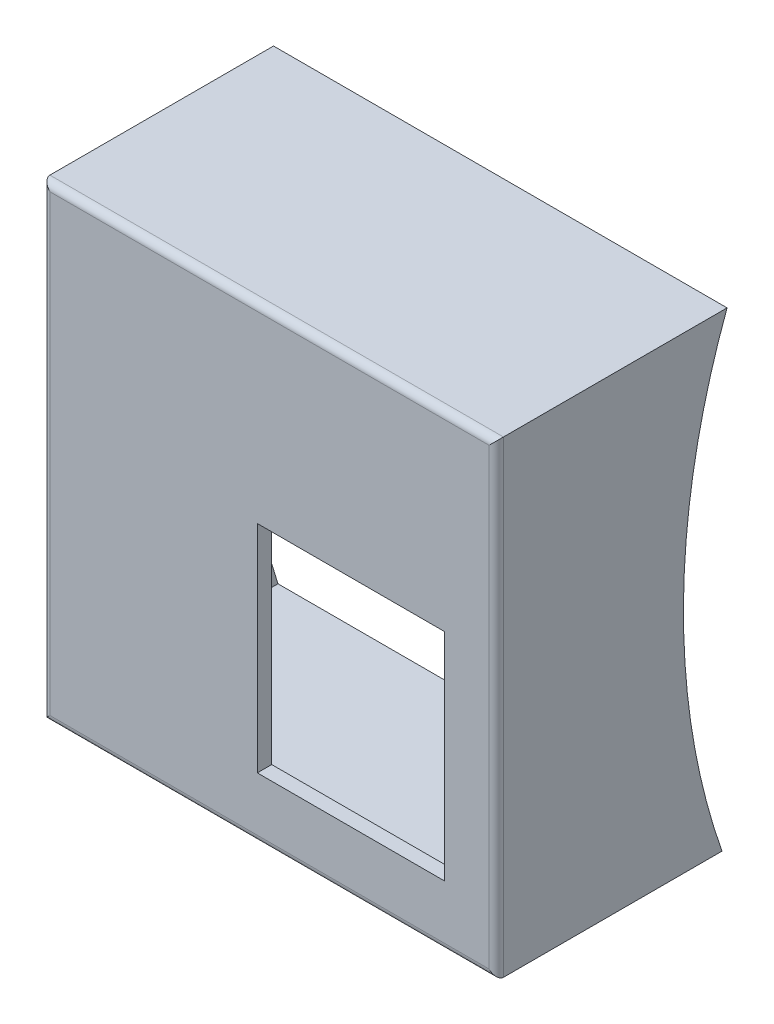
ISO-10303-21;
HEADER;
FILE_DESCRIPTION(('STEP AP214'),'2;1');
FILE_NAME('part.step','',(''),(''),'','','');
FILE_SCHEMA(('AUTOMOTIVE_DESIGN { 1 0 10303 214 1 1 1 1 }'));
ENDSEC;
DATA;
#1=APPLICATION_CONTEXT('core data for automotive mechanical design processes');
#2=APPLICATION_PROTOCOL_DEFINITION('international standard','automotive_design',2000,#1);
#3=PRODUCT_CONTEXT('',#1,'mechanical');
#4=PRODUCT('Part','Part','',(#3));
#5=PRODUCT_RELATED_PRODUCT_CATEGORY('part','',(#4));
#6=PRODUCT_DEFINITION_FORMATION('','',#4);
#7=PRODUCT_DEFINITION_CONTEXT('part definition',#1,'design');
#8=PRODUCT_DEFINITION('design','',#6,#7);
#9=PRODUCT_DEFINITION_SHAPE('','',#8);
#10=(LENGTH_UNIT() NAMED_UNIT(*) SI_UNIT(.MILLI.,.METRE.));
#11=(NAMED_UNIT(*) PLANE_ANGLE_UNIT() SI_UNIT($,.RADIAN.));
#12=(NAMED_UNIT(*) SI_UNIT($,.STERADIAN.) SOLID_ANGLE_UNIT());
#13=UNCERTAINTY_MEASURE_WITH_UNIT(LENGTH_MEASURE(1.E-05),#10,'distance_accuracy_value','');
#14=(GEOMETRIC_REPRESENTATION_CONTEXT(3) GLOBAL_UNCERTAINTY_ASSIGNED_CONTEXT((#13)) GLOBAL_UNIT_ASSIGNED_CONTEXT((#10,
#11,#12)) REPRESENTATION_CONTEXT('',''));
#15=CARTESIAN_POINT('',(0.,0.,0.));
#16=DIRECTION('',(0.,0.,1.));
#17=DIRECTION('',(1.,0.,0.));
#18=AXIS2_PLACEMENT_3D('',#15,#16,#17);
#19=CARTESIAN_POINT('',(-29.5,32.5,35.));
#20=DIRECTION('',(0.,-1.,0.));
#21=DIRECTION('',(0.,0.,-1.));
#22=AXIS2_PLACEMENT_3D('',#19,#20,#21);
#23=PLANE('',#22);
#24=DIRECTION('',(-1.,0.,0.));
#25=VECTOR('',#24,1.);
#26=CARTESIAN_POINT('',(34.9310414342069,32.5,4.93868352384369));
#27=LINE('',#26,#25);
#28=CARTESIAN_POINT('',(-31.5,32.5,4.93868352384369));
#29=VERTEX_POINT('',#28);
#30=CARTESIAN_POINT('',(31.5,32.5,4.93868352384369));
#31=VERTEX_POINT('',#30);
#32=EDGE_CURVE('E214',#29,#31,#27,.F.);
#33=ORIENTED_EDGE('',*,*,#32,.F.);
#34=DIRECTION('',(0.,0.,-1.));
#35=VECTOR('',#34,1.);
#36=CARTESIAN_POINT('',(-31.5,32.5,35.));
#37=LINE('',#36,#35);
#38=CARTESIAN_POINT('',(-31.5,32.5,36.));
#39=VERTEX_POINT('',#38);
#40=EDGE_CURVE('E186',#39,#29,#37,.T.);
#41=ORIENTED_EDGE('',*,*,#40,.F.);
#42=DIRECTION('',(-1.,0.,0.));
#43=VECTOR('',#42,1.);
#44=CARTESIAN_POINT('',(-29.5,32.5,36.));
#45=LINE('',#44,#43);
#46=CARTESIAN_POINT('',(31.5,32.5,36.));
#47=VERTEX_POINT('',#46);
#48=EDGE_CURVE('E159',#39,#47,#45,.F.);
#49=ORIENTED_EDGE('',*,*,#48,.T.);
#50=DIRECTION('',(0.,0.,-1.));
#51=VECTOR('',#50,1.);
#52=CARTESIAN_POINT('',(31.5,32.5,35.));
#53=LINE('',#52,#51);
#54=EDGE_CURVE('E180',#47,#31,#53,.T.);
#55=ORIENTED_EDGE('',*,*,#54,.T.);
#56=EDGE_LOOP('',(#33,#41,#49,#55));
#57=FACE_BOUND('',#56,.T.);
#58=ADVANCED_FACE('F33',(#57),#23,.F.);
#59=CARTESIAN_POINT('',(-29.5,-32.5,35.));
#60=DIRECTION('',(0.,1.,0.));
#61=DIRECTION('',(0.,0.,1.));
#62=AXIS2_PLACEMENT_3D('',#59,#60,#61);
#63=PLANE('',#62);
#64=DIRECTION('',(-1.,0.,0.));
#65=VECTOR('',#64,1.);
#66=CARTESIAN_POINT('',(34.9310414342069,-32.5,5.64631503967474));
#67=LINE('',#66,#65);
#68=CARTESIAN_POINT('',(31.5,-32.5,5.64631503967474));
#69=VERTEX_POINT('',#68);
#70=CARTESIAN_POINT('',(-31.5,-32.5,5.64631503967473));
#71=VERTEX_POINT('',#70);
#72=EDGE_CURVE('E213',#69,#71,#67,.T.);
#73=ORIENTED_EDGE('',*,*,#72,.F.);
#74=DIRECTION('',(0.,0.,-1.));
#75=VECTOR('',#74,1.);
#76=CARTESIAN_POINT('',(31.5,-32.5,35.));
#77=LINE('',#76,#75);
#78=CARTESIAN_POINT('',(31.5,-32.5,36.));
#79=VERTEX_POINT('',#78);
#80=EDGE_CURVE('E183',#79,#69,#77,.T.);
#81=ORIENTED_EDGE('',*,*,#80,.F.);
#82=DIRECTION('',(1.,0.,0.));
#83=VECTOR('',#82,1.);
#84=CARTESIAN_POINT('',(-29.5,-32.5,36.));
#85=LINE('',#84,#83);
#86=CARTESIAN_POINT('',(-31.5,-32.5,36.));
#87=VERTEX_POINT('',#86);
#88=EDGE_CURVE('E187',#79,#87,#85,.F.);
#89=ORIENTED_EDGE('',*,*,#88,.T.);
#90=DIRECTION('',(0.,0.,-1.));
#91=VECTOR('',#90,1.);
#92=CARTESIAN_POINT('',(-31.5,-32.5,35.));
#93=LINE('',#92,#91);
#94=EDGE_CURVE('E190',#87,#71,#93,.T.);
#95=ORIENTED_EDGE('',*,*,#94,.T.);
#96=EDGE_LOOP('',(#73,#81,#89,#95));
#97=FACE_BOUND('',#96,.T.);
#98=ADVANCED_FACE('F267',(#97),#63,.F.);
#99=CARTESIAN_POINT('',(-29.5,30.5,35.));
#100=DIRECTION('',(0.,-1.,0.));
#101=DIRECTION('',(0.,0.,-1.));
#102=AXIS2_PLACEMENT_3D('',#99,#100,#101);
#103=PLANE('',#102);
#104=DIRECTION('',(0.,0.,-1.));
#105=VECTOR('',#104,1.);
#106=CARTESIAN_POINT('',(-29.5,30.5,35.));
#107=LINE('',#106,#105);
#108=CARTESIAN_POINT('',(-29.5,30.5,35.));
#109=VERTEX_POINT('',#108);
#110=CARTESIAN_POINT('',(-29.5,30.5,5.66200140068614));
#111=VERTEX_POINT('',#110);
#112=EDGE_CURVE('E224',#109,#111,#107,.T.);
#113=ORIENTED_EDGE('',*,*,#112,.T.);
#114=DIRECTION('',(-1.,0.,0.));
#115=VECTOR('',#114,1.);
#116=CARTESIAN_POINT('',(34.9310414342069,30.5,5.66200140068614));
#117=LINE('',#116,#115);
#118=CARTESIAN_POINT('',(29.5,30.5,5.66200140068614));
#119=VERTEX_POINT('',#118);
#120=EDGE_CURVE('E206',#111,#119,#117,.F.);
#121=ORIENTED_EDGE('',*,*,#120,.T.);
#122=DIRECTION('',(0.,0.,-1.));
#123=VECTOR('',#122,1.);
#124=CARTESIAN_POINT('',(29.5,30.5,35.));
#125=LINE('',#124,#123);
#126=CARTESIAN_POINT('',(29.5,30.5,35.));
#127=VERTEX_POINT('',#126);
#128=EDGE_CURVE('E200',#127,#119,#125,.T.);
#129=ORIENTED_EDGE('',*,*,#128,.F.);
#130=DIRECTION('',(-1.,0.,0.));
#131=VECTOR('',#130,1.);
#132=CARTESIAN_POINT('',(-29.5,30.5,35.));
#133=LINE('',#132,#131);
#134=EDGE_CURVE('E204',#127,#109,#133,.T.);
#135=ORIENTED_EDGE('',*,*,#134,.T.);
#136=EDGE_LOOP('',(#113,#121,#129,#135));
#137=FACE_BOUND('',#136,.T.);
#138=ADVANCED_FACE('F273',(#137),#103,.T.);
#139=CARTESIAN_POINT('',(-29.5,-30.5,35.));
#140=DIRECTION('',(0.,1.,0.));
#141=DIRECTION('',(0.,0.,1.));
#142=AXIS2_PLACEMENT_3D('',#139,#140,#141);
#143=PLANE('',#142);
#144=DIRECTION('',(0.,0.,-1.));
#145=VECTOR('',#144,1.);
#146=CARTESIAN_POINT('',(29.5,-30.5,35.));
#147=LINE('',#146,#145);
#148=CARTESIAN_POINT('',(29.5,-30.5,35.));
#149=VERTEX_POINT('',#148);
#150=CARTESIAN_POINT('',(29.5,-30.5,6.32095686719458));
#151=VERTEX_POINT('',#150);
#152=EDGE_CURVE('E166',#149,#151,#147,.T.);
#153=ORIENTED_EDGE('',*,*,#152,.T.);
#154=DIRECTION('',(-1.,0.,0.));
#155=VECTOR('',#154,1.);
#156=CARTESIAN_POINT('',(34.9310414342069,-30.5,6.32095686719458));
#157=LINE('',#156,#155);
#158=CARTESIAN_POINT('',(-29.5,-30.5,6.32095686719458));
#159=VERTEX_POINT('',#158);
#160=EDGE_CURVE('E162',#151,#159,#157,.T.);
#161=ORIENTED_EDGE('',*,*,#160,.T.);
#162=DIRECTION('',(0.,0.,-1.));
#163=VECTOR('',#162,1.);
#164=CARTESIAN_POINT('',(-29.5,-30.5,35.));
#165=LINE('',#164,#163);
#166=CARTESIAN_POINT('',(-29.5,-30.5,35.));
#167=VERTEX_POINT('',#166);
#168=EDGE_CURVE('E210',#167,#159,#165,.T.);
#169=ORIENTED_EDGE('',*,*,#168,.F.);
#170=DIRECTION('',(1.,0.,0.));
#171=VECTOR('',#170,1.);
#172=CARTESIAN_POINT('',(-29.5,-30.5,35.));
#173=LINE('',#172,#171);
#174=EDGE_CURVE('E165',#167,#149,#173,.T.);
#175=ORIENTED_EDGE('',*,*,#174,.T.);
#176=EDGE_LOOP('',(#153,#161,#169,#175));
#177=FACE_BOUND('',#176,.T.);
#178=ADVANCED_FACE('F283',(#177),#143,.T.);
#179=CARTESIAN_POINT('',(31.5,-30.5,35.));
#180=DIRECTION('',(-1.,0.,0.));
#181=DIRECTION('',(0.,0.,1.));
#182=AXIS2_PLACEMENT_3D('',#179,#180,#181);
#183=PLANE('',#182);
#184=CARTESIAN_POINT('',(31.5,-0.977552215280204,-84.5012600006979));
#185=DIRECTION('',(-1.,0.,0.));
#186=DIRECTION('',(0.,0.,1.));
#187=AXIS2_PLACEMENT_3D('',#184,#185,#186);
#188=CIRCLE('',#187,95.5);
#189=EDGE_CURVE('E178',#31,#69,#188,.F.);
#190=ORIENTED_EDGE('',*,*,#189,.F.);
#191=ORIENTED_EDGE('',*,*,#54,.F.);
#192=DIRECTION('',(0.,1.,0.));
#193=VECTOR('',#192,1.);
#194=CARTESIAN_POINT('',(31.5,-30.5,36.));
#195=LINE('',#194,#193);
#196=EDGE_CURVE('E181',#47,#79,#195,.F.);
#197=ORIENTED_EDGE('',*,*,#196,.T.);
#198=ORIENTED_EDGE('',*,*,#80,.T.);
#199=EDGE_LOOP('',(#190,#191,#197,#198));
#200=FACE_BOUND('',#199,.T.);
#201=ADVANCED_FACE('F280',(#200),#183,.F.);
#202=CARTESIAN_POINT('',(-31.5,-30.5,35.));
#203=DIRECTION('',(1.,0.,0.));
#204=DIRECTION('',(0.,0.,-1.));
#205=AXIS2_PLACEMENT_3D('',#202,#203,#204);
#206=PLANE('',#205);
#207=CARTESIAN_POINT('',(-31.5,-0.977552215280203,-84.5012600006979));
#208=DIRECTION('',(1.,0.,0.));
#209=DIRECTION('',(0.,0.,-1.));
#210=AXIS2_PLACEMENT_3D('',#207,#208,#209);
#211=CIRCLE('',#210,95.5);
#212=EDGE_CURVE('E217',#71,#29,#211,.F.);
#213=ORIENTED_EDGE('',*,*,#212,.F.);
#214=ORIENTED_EDGE('',*,*,#94,.F.);
#215=DIRECTION('',(0.,-1.,0.));
#216=VECTOR('',#215,1.);
#217=CARTESIAN_POINT('',(-31.5,-30.5,36.));
#218=LINE('',#217,#216);
#219=EDGE_CURVE('E184',#87,#39,#218,.F.);
#220=ORIENTED_EDGE('',*,*,#219,.T.);
#221=ORIENTED_EDGE('',*,*,#40,.T.);
#222=EDGE_LOOP('',(#213,#214,#220,#221));
#223=FACE_BOUND('',#222,.T.);
#224=ADVANCED_FACE('F279',(#223),#206,.F.);
#225=CARTESIAN_POINT('',(0.,0.,37.));
#226=DIRECTION('',(0.,0.,-1.));
#227=DIRECTION('',(-1.,0.,0.));
#228=AXIS2_PLACEMENT_3D('',#225,#226,#227);
#229=PLANE('',#228);
#230=DIRECTION('',(-1.,0.,0.));
#231=VECTOR('',#230,1.);
#232=CARTESIAN_POINT('',(24.3111325786551,5.99879463488067,37.));
#233=LINE('',#232,#231);
#234=CARTESIAN_POINT('',(24.3111325786551,5.99879463488067,37.));
#235=VERTEX_POINT('',#234);
#236=CARTESIAN_POINT('',(-1.68886742134489,5.99879463488067,37.));
#237=VERTEX_POINT('',#236);
#238=EDGE_CURVE('E145',#235,#237,#233,.T.);
#239=ORIENTED_EDGE('',*,*,#238,.F.);
#240=DIRECTION('',(0.,1.,0.));
#241=VECTOR('',#240,1.);
#242=CARTESIAN_POINT('',(24.3111325786551,-24.0012053651193,37.));
#243=LINE('',#242,#241);
#244=CARTESIAN_POINT('',(24.3111325786551,-24.0012053651193,37.));
#245=VERTEX_POINT('',#244);
#246=EDGE_CURVE('E48',#245,#235,#243,.T.);
#247=ORIENTED_EDGE('',*,*,#246,.F.);
#248=DIRECTION('',(1.,0.,0.));
#249=VECTOR('',#248,1.);
#250=CARTESIAN_POINT('',(24.3111325786551,-24.0012053651193,37.));
#251=LINE('',#250,#249);
#252=CARTESIAN_POINT('',(-1.68886742134489,-24.0012053651193,37.));
#253=VERTEX_POINT('',#252);
#254=EDGE_CURVE('E152',#253,#245,#251,.T.);
#255=ORIENTED_EDGE('',*,*,#254,.F.);
#256=DIRECTION('',(0.,-1.,0.));
#257=VECTOR('',#256,1.);
#258=CARTESIAN_POINT('',(-1.68886742134489,-24.0012053651193,37.));
#259=LINE('',#258,#257);
#260=EDGE_CURVE('E136',#237,#253,#259,.T.);
#261=ORIENTED_EDGE('',*,*,#260,.F.);
#262=EDGE_LOOP('',(#239,#247,#255,#261));
#263=FACE_BOUND('',#262,.T.);
#264=DIRECTION('',(0.,-1.,0.));
#265=VECTOR('',#264,1.);
#266=CARTESIAN_POINT('',(-30.5,0.,37.));
#267=LINE('',#266,#265);
#268=CARTESIAN_POINT('',(-30.5,31.5,37.));
#269=VERTEX_POINT('',#268);
#270=CARTESIAN_POINT('',(-30.5,-31.5,37.));
#271=VERTEX_POINT('',#270);
#272=EDGE_CURVE('E195',#269,#271,#267,.T.);
#273=ORIENTED_EDGE('',*,*,#272,.T.);
#274=DIRECTION('',(1.,0.,0.));
#275=VECTOR('',#274,1.);
#276=CARTESIAN_POINT('',(0.,-31.5,37.));
#277=LINE('',#276,#275);
#278=CARTESIAN_POINT('',(30.5,-31.5,37.));
#279=VERTEX_POINT('',#278);
#280=EDGE_CURVE('E191',#271,#279,#277,.T.);
#281=ORIENTED_EDGE('',*,*,#280,.T.);
#282=DIRECTION('',(0.,1.,0.));
#283=VECTOR('',#282,1.);
#284=CARTESIAN_POINT('',(30.5,0.,37.));
#285=LINE('',#284,#283);
#286=CARTESIAN_POINT('',(30.5,31.5,37.));
#287=VERTEX_POINT('',#286);
#288=EDGE_CURVE('E194',#279,#287,#285,.T.);
#289=ORIENTED_EDGE('',*,*,#288,.T.);
#290=DIRECTION('',(-1.,0.,0.));
#291=VECTOR('',#290,1.);
#292=CARTESIAN_POINT('',(0.,31.5,37.));
#293=LINE('',#292,#291);
#294=EDGE_CURVE('E198',#287,#269,#293,.T.);
#295=ORIENTED_EDGE('',*,*,#294,.T.);
#296=EDGE_LOOP('',(#273,#281,#289,#295));
#297=FACE_BOUND('',#296,.T.);
#298=ADVANCED_FACE('F149',(#263,#297),#229,.F.);
#299=CARTESIAN_POINT('',(29.5,-30.5,35.));
#300=DIRECTION('',(-1.,0.,0.));
#301=DIRECTION('',(0.,0.,1.));
#302=AXIS2_PLACEMENT_3D('',#299,#300,#301);
#303=PLANE('',#302);
#304=ORIENTED_EDGE('',*,*,#128,.T.);
#305=CARTESIAN_POINT('',(29.5,-0.977552215280204,-84.5012600006979));
#306=DIRECTION('',(-1.,0.,0.));
#307=DIRECTION('',(0.,0.,1.));
#308=AXIS2_PLACEMENT_3D('',#305,#306,#307);
#309=CIRCLE('',#308,95.5);
#310=EDGE_CURVE('E211',#119,#151,#309,.F.);
#311=ORIENTED_EDGE('',*,*,#310,.T.);
#312=ORIENTED_EDGE('',*,*,#152,.F.);
#313=DIRECTION('',(0.,1.,0.));
#314=VECTOR('',#313,1.);
#315=CARTESIAN_POINT('',(29.5,-30.5,35.));
#316=LINE('',#315,#314);
#317=EDGE_CURVE('E207',#149,#127,#316,.T.);
#318=ORIENTED_EDGE('',*,*,#317,.T.);
#319=EDGE_LOOP('',(#304,#311,#312,#318));
#320=FACE_BOUND('',#319,.T.);
#321=ADVANCED_FACE('F35',(#320),#303,.T.);
#322=CARTESIAN_POINT('',(-29.5,-30.5,35.));
#323=DIRECTION('',(1.,0.,0.));
#324=DIRECTION('',(0.,0.,-1.));
#325=AXIS2_PLACEMENT_3D('',#322,#323,#324);
#326=PLANE('',#325);
#327=ORIENTED_EDGE('',*,*,#168,.T.);
#328=CARTESIAN_POINT('',(-29.5,-0.977552215280203,-84.5012600006979));
#329=DIRECTION('',(1.,0.,0.));
#330=DIRECTION('',(0.,0.,-1.));
#331=AXIS2_PLACEMENT_3D('',#328,#329,#330);
#332=CIRCLE('',#331,95.5);
#333=EDGE_CURVE('E203',#159,#111,#332,.F.);
#334=ORIENTED_EDGE('',*,*,#333,.T.);
#335=ORIENTED_EDGE('',*,*,#112,.F.);
#336=DIRECTION('',(0.,-1.,0.));
#337=VECTOR('',#336,1.);
#338=CARTESIAN_POINT('',(-29.5,-30.5,35.));
#339=LINE('',#338,#337);
#340=EDGE_CURVE('E171',#109,#167,#339,.T.);
#341=ORIENTED_EDGE('',*,*,#340,.T.);
#342=EDGE_LOOP('',(#327,#334,#335,#341));
#343=FACE_BOUND('',#342,.T.);
#344=ADVANCED_FACE('F288',(#343),#326,.T.);
#345=CARTESIAN_POINT('',(0.,0.,35.));
#346=DIRECTION('',(0.,0.,-1.));
#347=DIRECTION('',(-1.,0.,0.));
#348=AXIS2_PLACEMENT_3D('',#345,#346,#347);
#349=PLANE('',#348);
#350=DIRECTION('',(0.,-1.,0.));
#351=VECTOR('',#350,1.);
#352=CARTESIAN_POINT('',(24.3111325786551,0.,35.));
#353=LINE('',#352,#351);
#354=CARTESIAN_POINT('',(24.3111325786551,5.99879463488067,35.));
#355=VERTEX_POINT('',#354);
#356=CARTESIAN_POINT('',(24.3111325786551,-24.0012053651193,35.));
#357=VERTEX_POINT('',#356);
#358=EDGE_CURVE('E11',#355,#357,#353,.T.);
#359=ORIENTED_EDGE('',*,*,#358,.F.);
#360=DIRECTION('',(1.,0.,0.));
#361=VECTOR('',#360,1.);
#362=CARTESIAN_POINT('',(0.,5.99879463488067,35.));
#363=LINE('',#362,#361);
#364=CARTESIAN_POINT('',(-1.68886742134489,5.99879463488067,35.));
#365=VERTEX_POINT('',#364);
#366=EDGE_CURVE('E216',#365,#355,#363,.T.);
#367=ORIENTED_EDGE('',*,*,#366,.F.);
#368=DIRECTION('',(0.,1.,0.));
#369=VECTOR('',#368,1.);
#370=CARTESIAN_POINT('',(-1.68886742134489,0.,35.));
#371=LINE('',#370,#369);
#372=CARTESIAN_POINT('',(-1.68886742134489,-24.0012053651193,35.));
#373=VERTEX_POINT('',#372);
#374=EDGE_CURVE('E139',#373,#365,#371,.T.);
#375=ORIENTED_EDGE('',*,*,#374,.F.);
#376=DIRECTION('',(-1.,0.,0.));
#377=VECTOR('',#376,1.);
#378=CARTESIAN_POINT('',(0.,-24.0012053651193,35.));
#379=LINE('',#378,#377);
#380=EDGE_CURVE('E41',#357,#373,#379,.T.);
#381=ORIENTED_EDGE('',*,*,#380,.F.);
#382=EDGE_LOOP('',(#359,#367,#375,#381));
#383=FACE_BOUND('',#382,.T.);
#384=ORIENTED_EDGE('',*,*,#317,.F.);
#385=ORIENTED_EDGE('',*,*,#174,.F.);
#386=ORIENTED_EDGE('',*,*,#340,.F.);
#387=ORIENTED_EDGE('',*,*,#134,.F.);
#388=EDGE_LOOP('',(#384,#385,#386,#387));
#389=FACE_BOUND('',#388,.T.);
#390=ADVANCED_FACE('F250',(#383,#389),#349,.T.);
#391=CARTESIAN_POINT('',(0.,31.5,36.));
#392=DIRECTION('',(-1.,0.,0.));
#393=DIRECTION('',(0.,0.,1.));
#394=AXIS2_PLACEMENT_3D('',#391,#392,#393);
#395=CYLINDRICAL_SURFACE('',#394,1.);
#396=CARTESIAN_POINT('',(30.5,31.5,36.));
#397=DIRECTION('',(-0.707106781186547,0.707106781186547,0.));
#398=DIRECTION('',(-0.707106781186547,-0.707106781186547,0.));
#399=AXIS2_PLACEMENT_3D('',#396,#397,#398);
#400=ELLIPSE('',#399,1.41421356237309,1.);
#401=EDGE_CURVE('E170',#47,#287,#400,.F.);
#402=ORIENTED_EDGE('',*,*,#401,.F.);
#403=ORIENTED_EDGE('',*,*,#48,.F.);
#404=CARTESIAN_POINT('',(-30.5,31.5,36.));
#405=DIRECTION('',(-0.707106781186547,-0.707106781186547,0.));
#406=DIRECTION('',(-0.707106781186547,0.707106781186547,0.));
#407=AXIS2_PLACEMENT_3D('',#404,#405,#406);
#408=ELLIPSE('',#407,1.41421356237309,1.);
#409=EDGE_CURVE('E167',#269,#39,#408,.T.);
#410=ORIENTED_EDGE('',*,*,#409,.F.);
#411=ORIENTED_EDGE('',*,*,#294,.F.);
#412=EDGE_LOOP('',(#402,#403,#410,#411));
#413=FACE_BOUND('',#412,.T.);
#414=ADVANCED_FACE('F326',(#413),#395,.T.);
#415=CARTESIAN_POINT('',(-30.5,0.,36.));
#416=DIRECTION('',(0.,-1.,0.));
#417=DIRECTION('',(0.,0.,-1.));
#418=AXIS2_PLACEMENT_3D('',#415,#416,#417);
#419=CYLINDRICAL_SURFACE('',#418,1.);
#420=ORIENTED_EDGE('',*,*,#409,.T.);
#421=ORIENTED_EDGE('',*,*,#219,.F.);
#422=CARTESIAN_POINT('',(-30.5,-31.5,36.));
#423=DIRECTION('',(0.707106781186547,-0.707106781186547,0.));
#424=DIRECTION('',(-0.707106781186547,-0.707106781186547,0.));
#425=AXIS2_PLACEMENT_3D('',#422,#423,#424);
#426=ELLIPSE('',#425,1.41421356237309,1.);
#427=EDGE_CURVE('E174',#271,#87,#426,.T.);
#428=ORIENTED_EDGE('',*,*,#427,.F.);
#429=ORIENTED_EDGE('',*,*,#272,.F.);
#430=EDGE_LOOP('',(#420,#421,#428,#429));
#431=FACE_BOUND('',#430,.T.);
#432=ADVANCED_FACE('F330',(#431),#419,.T.);
#433=CARTESIAN_POINT('',(30.5,0.,36.));
#434=DIRECTION('',(0.,1.,0.));
#435=DIRECTION('',(0.,0.,1.));
#436=AXIS2_PLACEMENT_3D('',#433,#434,#435);
#437=CYLINDRICAL_SURFACE('',#436,1.);
#438=ORIENTED_EDGE('',*,*,#401,.T.);
#439=ORIENTED_EDGE('',*,*,#288,.F.);
#440=CARTESIAN_POINT('',(30.5,-31.5,36.));
#441=DIRECTION('',(0.707106781186547,0.707106781186547,0.));
#442=DIRECTION('',(-0.707106781186547,0.707106781186547,0.));
#443=AXIS2_PLACEMENT_3D('',#440,#441,#442);
#444=ELLIPSE('',#443,1.41421356237309,1.);
#445=EDGE_CURVE('E176',#79,#279,#444,.F.);
#446=ORIENTED_EDGE('',*,*,#445,.F.);
#447=ORIENTED_EDGE('',*,*,#196,.F.);
#448=EDGE_LOOP('',(#438,#439,#446,#447));
#449=FACE_BOUND('',#448,.T.);
#450=ADVANCED_FACE('F315',(#449),#437,.T.);
#451=CARTESIAN_POINT('',(0.,-31.5,36.));
#452=DIRECTION('',(1.,0.,0.));
#453=DIRECTION('',(0.,0.,-1.));
#454=AXIS2_PLACEMENT_3D('',#451,#452,#453);
#455=CYLINDRICAL_SURFACE('',#454,1.);
#456=ORIENTED_EDGE('',*,*,#427,.T.);
#457=ORIENTED_EDGE('',*,*,#88,.F.);
#458=ORIENTED_EDGE('',*,*,#445,.T.);
#459=ORIENTED_EDGE('',*,*,#280,.F.);
#460=EDGE_LOOP('',(#456,#457,#458,#459));
#461=FACE_BOUND('',#460,.T.);
#462=ADVANCED_FACE('F261',(#461),#455,.T.);
#463=CARTESIAN_POINT('',(34.9310414342069,-0.977552215280204,-84.5012600006979));
#464=DIRECTION('',(-1.,0.,0.));
#465=DIRECTION('',(0.,-0.995378462174074,-0.0960297716334606));
#466=AXIS2_PLACEMENT_3D('',#463,#464,#465);
#467=CYLINDRICAL_SURFACE('',#466,95.5);
#468=ORIENTED_EDGE('',*,*,#120,.F.);
#469=ORIENTED_EDGE('',*,*,#333,.F.);
#470=ORIENTED_EDGE('',*,*,#160,.F.);
#471=ORIENTED_EDGE('',*,*,#310,.F.);
#472=EDGE_LOOP('',(#468,#469,#470,#471));
#473=FACE_BOUND('',#472,.T.);
#474=ORIENTED_EDGE('',*,*,#189,.T.);
#475=ORIENTED_EDGE('',*,*,#72,.T.);
#476=ORIENTED_EDGE('',*,*,#212,.T.);
#477=ORIENTED_EDGE('',*,*,#32,.T.);
#478=EDGE_LOOP('',(#474,#475,#476,#477));
#479=FACE_BOUND('',#478,.T.);
#480=ADVANCED_FACE('F254',(#473,#479),#467,.F.);
#481=CARTESIAN_POINT('',(24.3111325786551,-24.0012053651193,25.));
#482=DIRECTION('',(1.,0.,0.));
#483=DIRECTION('',(0.,0.,-1.));
#484=AXIS2_PLACEMENT_3D('',#481,#482,#483);
#485=PLANE('',#484);
#486=ORIENTED_EDGE('',*,*,#358,.T.);
#487=DIRECTION('',(0.,0.,1.));
#488=VECTOR('',#487,1.);
#489=CARTESIAN_POINT('',(24.3111325786551,-24.0012053651193,25.));
#490=LINE('',#489,#488);
#491=EDGE_CURVE('E157',#357,#245,#490,.T.);
#492=ORIENTED_EDGE('',*,*,#491,.T.);
#493=ORIENTED_EDGE('',*,*,#246,.T.);
#494=DIRECTION('',(0.,0.,1.));
#495=VECTOR('',#494,1.);
#496=CARTESIAN_POINT('',(24.3111325786551,5.99879463488067,25.));
#497=LINE('',#496,#495);
#498=EDGE_CURVE('E142',#355,#235,#497,.T.);
#499=ORIENTED_EDGE('',*,*,#498,.F.);
#500=EDGE_LOOP('',(#486,#492,#493,#499));
#501=FACE_BOUND('',#500,.T.);
#502=ADVANCED_FACE('F252',(#501),#485,.F.);
#503=CARTESIAN_POINT('',(24.3111325786551,-24.0012053651193,25.));
#504=DIRECTION('',(0.,-1.,0.));
#505=DIRECTION('',(1.,0.,0.));
#506=AXIS2_PLACEMENT_3D('',#503,#504,#505);
#507=PLANE('',#506);
#508=ORIENTED_EDGE('',*,*,#380,.T.);
#509=DIRECTION('',(0.,0.,1.));
#510=VECTOR('',#509,1.);
#511=CARTESIAN_POINT('',(-1.68886742134489,-24.0012053651193,25.));
#512=LINE('',#511,#510);
#513=EDGE_CURVE('E141',#373,#253,#512,.T.);
#514=ORIENTED_EDGE('',*,*,#513,.T.);
#515=ORIENTED_EDGE('',*,*,#254,.T.);
#516=ORIENTED_EDGE('',*,*,#491,.F.);
#517=EDGE_LOOP('',(#508,#514,#515,#516));
#518=FACE_BOUND('',#517,.T.);
#519=ADVANCED_FACE('F247',(#518),#507,.F.);
#520=CARTESIAN_POINT('',(-1.68886742134489,-24.0012053651193,25.));
#521=DIRECTION('',(-1.,0.,0.));
#522=DIRECTION('',(0.,0.,1.));
#523=AXIS2_PLACEMENT_3D('',#520,#521,#522);
#524=PLANE('',#523);
#525=ORIENTED_EDGE('',*,*,#374,.T.);
#526=DIRECTION('',(0.,0.,1.));
#527=VECTOR('',#526,1.);
#528=CARTESIAN_POINT('',(-1.68886742134489,5.99879463488067,25.));
#529=LINE('',#528,#527);
#530=EDGE_CURVE('E56',#365,#237,#529,.T.);
#531=ORIENTED_EDGE('',*,*,#530,.T.);
#532=ORIENTED_EDGE('',*,*,#260,.T.);
#533=ORIENTED_EDGE('',*,*,#513,.F.);
#534=EDGE_LOOP('',(#525,#531,#532,#533));
#535=FACE_BOUND('',#534,.T.);
#536=ADVANCED_FACE('F133',(#535),#524,.F.);
#537=CARTESIAN_POINT('',(24.3111325786551,5.99879463488067,25.));
#538=DIRECTION('',(0.,1.,0.));
#539=DIRECTION('',(-1.,0.,0.));
#540=AXIS2_PLACEMENT_3D('',#537,#538,#539);
#541=PLANE('',#540);
#542=ORIENTED_EDGE('',*,*,#366,.T.);
#543=ORIENTED_EDGE('',*,*,#498,.T.);
#544=ORIENTED_EDGE('',*,*,#238,.T.);
#545=ORIENTED_EDGE('',*,*,#530,.F.);
#546=EDGE_LOOP('',(#542,#543,#544,#545));
#547=FACE_BOUND('',#546,.T.);
#548=ADVANCED_FACE('F146',(#547),#541,.F.);
#549=CLOSED_SHELL('',(#58,#98,#138,#178,#201,#224,#298,#321,#344,#390,#414,#432,#450,#462,#480,
#502,#519,#536,#548));
#550=MANIFOLD_SOLID_BREP('B2',#549);
#551=ADVANCED_BREP_SHAPE_REPRESENTATION('',(#18,#550),#14);
#552=SHAPE_DEFINITION_REPRESENTATION(#9,#551);
ENDSEC;
END-ISO-10303-21;
